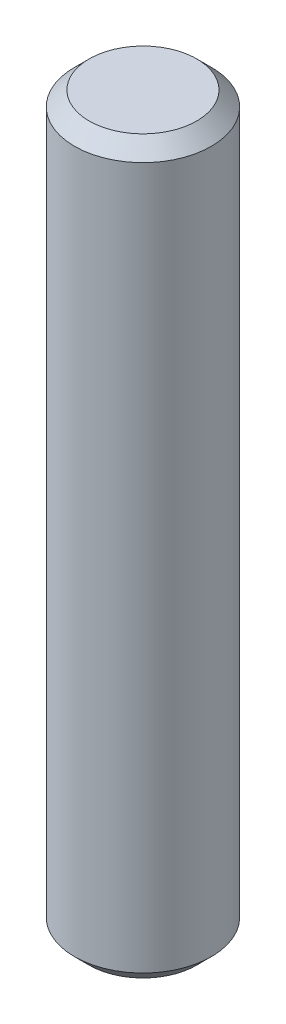
ISO-10303-21;
HEADER;
FILE_DESCRIPTION(('STEP AP214'),'2;1');
FILE_NAME('part.step','',(''),(''),'','','');
FILE_SCHEMA(('AUTOMOTIVE_DESIGN { 1 0 10303 214 1 1 1 1 }'));
ENDSEC;
DATA;
#1=APPLICATION_CONTEXT('core data for automotive mechanical design processes');
#2=APPLICATION_PROTOCOL_DEFINITION('international standard','automotive_design',2000,#1);
#3=PRODUCT_CONTEXT('',#1,'mechanical');
#4=PRODUCT('Part','Part','',(#3));
#5=PRODUCT_RELATED_PRODUCT_CATEGORY('part','',(#4));
#6=PRODUCT_DEFINITION_FORMATION('','',#4);
#7=PRODUCT_DEFINITION_CONTEXT('part definition',#1,'design');
#8=PRODUCT_DEFINITION('design','',#6,#7);
#9=PRODUCT_DEFINITION_SHAPE('','',#8);
#10=(LENGTH_UNIT() NAMED_UNIT(*) SI_UNIT(.MILLI.,.METRE.));
#11=(NAMED_UNIT(*) PLANE_ANGLE_UNIT() SI_UNIT($,.RADIAN.));
#12=(NAMED_UNIT(*) SI_UNIT($,.STERADIAN.) SOLID_ANGLE_UNIT());
#13=UNCERTAINTY_MEASURE_WITH_UNIT(LENGTH_MEASURE(1.E-05),#10,'distance_accuracy_value','');
#14=(GEOMETRIC_REPRESENTATION_CONTEXT(3) GLOBAL_UNCERTAINTY_ASSIGNED_CONTEXT((#13)) GLOBAL_UNIT_ASSIGNED_CONTEXT((#10,
#11,#12)) REPRESENTATION_CONTEXT('',''));
#15=CARTESIAN_POINT('',(0.,0.,0.));
#16=DIRECTION('',(0.,0.,1.));
#17=DIRECTION('',(1.,0.,0.));
#18=AXIS2_PLACEMENT_3D('',#15,#16,#17);
#19=CARTESIAN_POINT('',(-2.84400944537479E-11,0.508000000000008,0.));
#20=DIRECTION('',(0.,1.,0.));
#21=DIRECTION('',(0.,0.,1.));
#22=AXIS2_PLACEMENT_3D('',#19,#20,#21);
#23=CONICAL_SURFACE('',#22,2.37743999997882,0.785398163397448);
#24=CARTESIAN_POINT('',(-2.84400944537479E-11,2.8421709430404E-11,0.));
#25=DIRECTION('',(0.,1.,0.));
#26=DIRECTION('',(0.,0.,1.));
#27=AXIS2_PLACEMENT_3D('',#24,#25,#26);
#28=CIRCLE('',#27,1.86944000000723);
#29=CARTESIAN_POINT('',(-2.84400944537479E-11,2.8421709430404E-11,1.86944000000723));
#30=VERTEX_POINT('',#29);
#31=EDGE_CURVE('E54',#30,#30,#28,.T.);
#32=ORIENTED_EDGE('',*,*,#31,.T.);
#33=EDGE_LOOP('',(#32));
#34=FACE_BOUND('',#33,.T.);
#35=CARTESIAN_POINT('',(-2.84400944537479E-11,0.508000000000008,0.));
#36=DIRECTION('',(0.,1.,0.));
#37=DIRECTION('',(0.,0.,1.));
#38=AXIS2_PLACEMENT_3D('',#35,#36,#37);
#39=CIRCLE('',#38,2.37743999997882);
#40=CARTESIAN_POINT('',(-2.84400944537479E-11,0.508000000000008,2.37743999997882));
#41=VERTEX_POINT('',#40);
#42=EDGE_CURVE('E12',#41,#41,#39,.T.);
#43=ORIENTED_EDGE('',*,*,#42,.F.);
#44=EDGE_LOOP('',(#43));
#45=FACE_BOUND('',#44,.T.);
#46=ADVANCED_FACE('F40',(#34,#45),#23,.T.);
#47=CARTESIAN_POINT('',(-2.84400944537479E-11,2.8421709430404E-11,0.));
#48=DIRECTION('',(0.,1.,0.));
#49=DIRECTION('',(0.,0.,1.));
#50=AXIS2_PLACEMENT_3D('',#47,#48,#49);
#51=CYLINDRICAL_SURFACE('',#50,2.37743999997882);
#52=ORIENTED_EDGE('',*,*,#42,.T.);
#53=EDGE_LOOP('',(#52));
#54=FACE_BOUND('',#53,.T.);
#55=CARTESIAN_POINT('',(-2.84400944537479E-11,24.8920000000546,0.));
#56=DIRECTION('',(0.,1.,0.));
#57=DIRECTION('',(0.,0.,1.));
#58=AXIS2_PLACEMENT_3D('',#55,#56,#57);
#59=CIRCLE('',#58,2.37743999997882);
#60=CARTESIAN_POINT('',(-2.84400944537479E-11,24.8920000000546,2.37743999997882));
#61=VERTEX_POINT('',#60);
#62=EDGE_CURVE('E46',#61,#61,#59,.T.);
#63=ORIENTED_EDGE('',*,*,#62,.F.);
#64=EDGE_LOOP('',(#63));
#65=FACE_BOUND('',#64,.T.);
#66=ADVANCED_FACE('F73',(#54,#65),#51,.T.);
#67=CARTESIAN_POINT('',(-2.84400944537479E-11,25.4000000000237,0.));
#68=DIRECTION('',(0.,-1.,0.));
#69=DIRECTION('',(0.,0.,-1.));
#70=AXIS2_PLACEMENT_3D('',#67,#68,#69);
#71=CONICAL_SURFACE('',#70,1.86944000000973,0.785398163397447);
#72=ORIENTED_EDGE('',*,*,#62,.T.);
#73=EDGE_LOOP('',(#72));
#74=FACE_BOUND('',#73,.T.);
#75=CARTESIAN_POINT('',(-2.84400944537479E-11,25.4000000000237,0.));
#76=DIRECTION('',(0.,1.,0.));
#77=DIRECTION('',(0.,0.,1.));
#78=AXIS2_PLACEMENT_3D('',#75,#76,#77);
#79=CIRCLE('',#78,1.86944000000973);
#80=CARTESIAN_POINT('',(-2.84400944537479E-11,25.4000000000237,1.86944000000973));
#81=VERTEX_POINT('',#80);
#82=EDGE_CURVE('E50',#81,#81,#79,.T.);
#83=ORIENTED_EDGE('',*,*,#82,.F.);
#84=EDGE_LOOP('',(#83));
#85=FACE_BOUND('',#84,.T.);
#86=ADVANCED_FACE('F69',(#74,#85),#71,.T.);
#87=CARTESIAN_POINT('',(-2.84400944537479E-11,25.4000000000237,0.));
#88=DIRECTION('',(0.,1.,0.));
#89=DIRECTION('',(0.,0.,1.));
#90=AXIS2_PLACEMENT_3D('',#87,#88,#89);
#91=PLANE('',#90);
#92=ORIENTED_EDGE('',*,*,#82,.T.);
#93=EDGE_LOOP('',(#92));
#94=FACE_BOUND('',#93,.T.);
#95=ADVANCED_FACE('F64',(#94),#91,.T.);
#96=CARTESIAN_POINT('',(1.86943999997879,2.8421709430404E-11,0.));
#97=DIRECTION('',(0.,-1.,0.));
#98=DIRECTION('',(0.,0.,-1.));
#99=AXIS2_PLACEMENT_3D('',#96,#97,#98);
#100=PLANE('',#99);
#101=ORIENTED_EDGE('',*,*,#31,.F.);
#102=EDGE_LOOP('',(#101));
#103=FACE_BOUND('',#102,.T.);
#104=ADVANCED_FACE('F62',(#103),#100,.T.);
#105=CLOSED_SHELL('',(#46,#66,#86,#95,#104));
#106=MANIFOLD_SOLID_BREP('B2',#105);
#107=ADVANCED_BREP_SHAPE_REPRESENTATION('',(#18,#106),#14);
#108=SHAPE_DEFINITION_REPRESENTATION(#9,#107);
ENDSEC;
END-ISO-10303-21;
